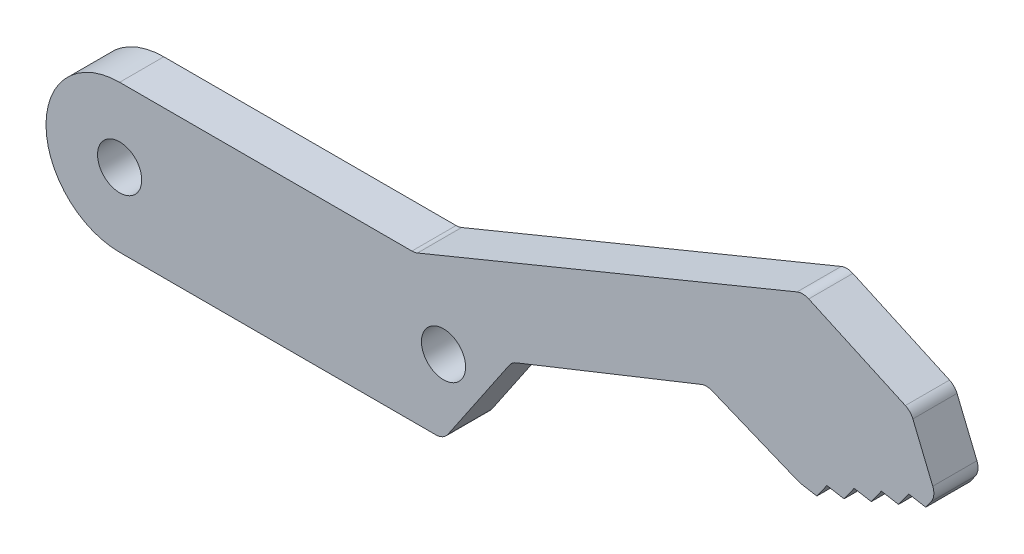
ISO-10303-21;
HEADER;
FILE_DESCRIPTION(('STEP AP214'),'2;1');
FILE_NAME('part.step','',(''),(''),'','','');
FILE_SCHEMA(('AUTOMOTIVE_DESIGN { 1 0 10303 214 1 1 1 1 }'));
ENDSEC;
DATA;
#1=APPLICATION_CONTEXT('core data for automotive mechanical design processes');
#2=APPLICATION_PROTOCOL_DEFINITION('international standard','automotive_design',2000,#1);
#3=PRODUCT_CONTEXT('',#1,'mechanical');
#4=PRODUCT('Part','Part','',(#3));
#5=PRODUCT_RELATED_PRODUCT_CATEGORY('part','',(#4));
#6=PRODUCT_DEFINITION_FORMATION('','',#4);
#7=PRODUCT_DEFINITION_CONTEXT('part definition',#1,'design');
#8=PRODUCT_DEFINITION('design','',#6,#7);
#9=PRODUCT_DEFINITION_SHAPE('','',#8);
#10=(LENGTH_UNIT() NAMED_UNIT(*) SI_UNIT(.MILLI.,.METRE.));
#11=(NAMED_UNIT(*) PLANE_ANGLE_UNIT() SI_UNIT($,.RADIAN.));
#12=(NAMED_UNIT(*) SI_UNIT($,.STERADIAN.) SOLID_ANGLE_UNIT());
#13=UNCERTAINTY_MEASURE_WITH_UNIT(LENGTH_MEASURE(1.E-05),#10,'distance_accuracy_value','');
#14=(GEOMETRIC_REPRESENTATION_CONTEXT(3) GLOBAL_UNCERTAINTY_ASSIGNED_CONTEXT((#13)) GLOBAL_UNIT_ASSIGNED_CONTEXT((#10,
#11,#12)) REPRESENTATION_CONTEXT('',''));
#15=CARTESIAN_POINT('',(0.,0.,0.));
#16=DIRECTION('',(0.,0.,1.));
#17=DIRECTION('',(1.,0.,0.));
#18=AXIS2_PLACEMENT_3D('',#15,#16,#17);
#19=CARTESIAN_POINT('',(17.3962094769043,-11.7918515015879,3.));
#20=DIRECTION('',(0.82775687017251,-0.561086948593719,0.));
#21=DIRECTION('',(0.561086948593719,0.82775687017251,0.));
#22=AXIS2_PLACEMENT_3D('',#19,#20,#21);
#23=PLANE('',#22);
#24=DIRECTION('',(-0.561086948593719,-0.82775687017251,0.));
#25=VECTOR('',#24,1.);
#26=CARTESIAN_POINT('',(17.3962094769043,-11.7918515015879,0.));
#27=LINE('',#26,#25);
#28=CARTESIAN_POINT('',(26.4721926347983,1.59770858592846,0.));
#29=VERTEX_POINT('',#28);
#30=CARTESIAN_POINT('',(22.2975129456313,-4.56108694859372,0.));
#31=VERTEX_POINT('',#30);
#32=EDGE_CURVE('E353',#29,#31,#27,.T.);
#33=ORIENTED_EDGE('',*,*,#32,.F.);
#34=DIRECTION('',(0.,0.,-1.));
#35=VECTOR('',#34,1.);
#36=CARTESIAN_POINT('',(26.4721926347983,1.59770858592845,3.));
#37=LINE('',#36,#35);
#38=CARTESIAN_POINT('',(26.4721926347983,1.59770858592846,3.));
#39=VERTEX_POINT('',#38);
#40=EDGE_CURVE('E256',#29,#39,#37,.F.);
#41=ORIENTED_EDGE('',*,*,#40,.T.);
#42=DIRECTION('',(-0.561086948593719,-0.82775687017251,0.));
#43=VECTOR('',#42,1.);
#44=CARTESIAN_POINT('',(17.3962094769043,-11.7918515015879,3.));
#45=LINE('',#44,#43);
#46=CARTESIAN_POINT('',(22.2975129456313,-4.56108694859372,3.));
#47=VERTEX_POINT('',#46);
#48=EDGE_CURVE('E770',#39,#47,#45,.T.);
#49=ORIENTED_EDGE('',*,*,#48,.T.);
#50=DIRECTION('',(0.,0.,-1.));
#51=VECTOR('',#50,1.);
#52=CARTESIAN_POINT('',(22.2975129456313,-4.56108694859372,0.));
#53=LINE('',#52,#51);
#54=EDGE_CURVE('E253',#47,#31,#53,.T.);
#55=ORIENTED_EDGE('',*,*,#54,.T.);
#56=EDGE_LOOP('',(#33,#41,#49,#55));
#57=FACE_BOUND('',#56,.T.);
#58=ADVANCED_FACE('F36',(#57),#23,.T.);
#59=CARTESIAN_POINT('',(3.01771045687276,-7.56855690668185,3.));
#60=DIRECTION('',(0.370362872235569,-0.928887152925166,0.));
#61=DIRECTION('',(0.928887152925166,0.370362872235569,0.));
#62=AXIS2_PLACEMENT_3D('',#59,#60,#61);
#63=PLANE('',#62);
#64=DIRECTION('',(-0.928887152925166,-0.370362872235569,0.));
#65=VECTOR('',#64,1.);
#66=CARTESIAN_POINT('',(3.01771045687276,-7.56855690668185,3.));
#67=LINE('',#66,#65);
#68=CARTESIAN_POINT('',(39.4964940516571,6.97614534835353,3.));
#69=VERTEX_POINT('',#68);
#70=CARTESIAN_POINT('',(26.9295866327353,1.9655087902599,3.));
#71=VERTEX_POINT('',#70);
#72=EDGE_CURVE('E777',#69,#71,#67,.T.);
#73=ORIENTED_EDGE('',*,*,#72,.T.);
#74=DIRECTION('',(0.,0.,-1.));
#75=VECTOR('',#74,1.);
#76=CARTESIAN_POINT('',(26.9295866327353,1.9655087902599,0.));
#77=LINE('',#76,#75);
#78=CARTESIAN_POINT('',(26.9295866327353,1.9655087902599,0.));
#79=VERTEX_POINT('',#78);
#80=EDGE_CURVE('E245',#71,#79,#77,.T.);
#81=ORIENTED_EDGE('',*,*,#80,.T.);
#82=DIRECTION('',(-0.928887152925166,-0.370362872235569,0.));
#83=VECTOR('',#82,1.);
#84=CARTESIAN_POINT('',(3.01771045687276,-7.56855690668185,0.));
#85=LINE('',#84,#83);
#86=CARTESIAN_POINT('',(39.4964940516571,6.97614534835353,0.));
#87=VERTEX_POINT('',#86);
#88=EDGE_CURVE('E355',#87,#79,#85,.T.);
#89=ORIENTED_EDGE('',*,*,#88,.F.);
#90=DIRECTION('',(0.,0.,-1.));
#91=VECTOR('',#90,1.);
#92=CARTESIAN_POINT('',(39.4964940516571,6.97614534835353,3.));
#93=LINE('',#92,#91);
#94=EDGE_CURVE('E243',#87,#69,#93,.F.);
#95=ORIENTED_EDGE('',*,*,#94,.T.);
#96=EDGE_LOOP('',(#73,#81,#89,#95));
#97=FACE_BOUND('',#96,.T.);
#98=ADVANCED_FACE('F498',(#97),#63,.T.);
#99=CARTESIAN_POINT('',(8.22079154562797,20.0822867610106,3.));
#100=DIRECTION('',(-0.378842481424512,-0.925461168428,0.));
#101=DIRECTION('',(0.925461168428,-0.378842481424512,0.));
#102=AXIS2_PLACEMENT_3D('',#99,#100,#101);
#103=PLANE('',#102);
#104=DIRECTION('',(-0.925461168428,0.378842481424512,0.));
#105=VECTOR('',#104,1.);
#106=CARTESIAN_POINT('',(8.22079154562797,20.0822867610106,3.));
#107=LINE('',#106,#105);
#108=CARTESIAN_POINT('',(46.0879419933528,4.58116609869354,3.));
#109=VERTEX_POINT('',#108);
#110=CARTESIAN_POINT('',(40.2456994053172,6.97271936385637,3.));
#111=VERTEX_POINT('',#110);
#112=EDGE_CURVE('E228',#109,#111,#107,.T.);
#113=ORIENTED_EDGE('',*,*,#112,.T.);
#114=DIRECTION('',(0.,0.,-1.));
#115=VECTOR('',#114,1.);
#116=CARTESIAN_POINT('',(40.2456994053171,6.97271936385637,0.));
#117=LINE('',#116,#115);
#118=CARTESIAN_POINT('',(40.2456994053172,6.97271936385637,0.));
#119=VERTEX_POINT('',#118);
#120=EDGE_CURVE('E280',#111,#119,#117,.T.);
#121=ORIENTED_EDGE('',*,*,#120,.T.);
#122=DIRECTION('',(-0.925461168428,0.378842481424512,0.));
#123=VECTOR('',#122,1.);
#124=CARTESIAN_POINT('',(8.22079154562797,20.0822867610106,0.));
#125=LINE('',#124,#123);
#126=CARTESIAN_POINT('',(46.0879419933528,4.58116609869354,0.));
#127=VERTEX_POINT('',#126);
#128=EDGE_CURVE('E358',#127,#119,#125,.T.);
#129=ORIENTED_EDGE('',*,*,#128,.F.);
#130=DIRECTION('',(0.,0.,-1.));
#131=VECTOR('',#130,1.);
#132=CARTESIAN_POINT('',(46.0879419933528,4.58116609869354,3.));
#133=LINE('',#132,#131);
#134=EDGE_CURVE('E278',#127,#109,#133,.F.);
#135=ORIENTED_EDGE('',*,*,#134,.T.);
#136=EDGE_LOOP('',(#113,#121,#129,#135));
#137=FACE_BOUND('',#136,.T.);
#138=ADVANCED_FACE('F504',(#137),#103,.T.);
#139=CARTESIAN_POINT('',(2.12068725055261,12.2001062019428,3.));
#140=DIRECTION('',(0.171257275030367,0.985226342395073,0.));
#141=DIRECTION('',(-0.985226342395073,0.171257275030367,0.));
#142=AXIS2_PLACEMENT_3D('',#139,#140,#141);
#143=PLANE('',#142);
#144=DIRECTION('',(0.985226342395073,-0.171257275030367,0.));
#145=VECTOR('',#144,1.);
#146=CARTESIAN_POINT('',(2.12068725055261,12.2001062019428,3.));
#147=LINE('',#146,#145);
#148=CARTESIAN_POINT('',(46.2955271997469,4.52140092472648,3.));
#149=VERTEX_POINT('',#148);
#150=CARTESIAN_POINT('',(47.3529322035688,4.33759717145107,3.));
#151=VERTEX_POINT('',#150);
#152=EDGE_CURVE('E214',#149,#151,#147,.T.);
#153=ORIENTED_EDGE('',*,*,#152,.F.);
#154=DIRECTION('',(0.,0.,-1.));
#155=VECTOR('',#154,1.);
#156=CARTESIAN_POINT('',(46.2955271997469,4.52140092472648,0.));
#157=LINE('',#156,#155);
#158=CARTESIAN_POINT('',(46.2955271997469,4.52140092472648,0.));
#159=VERTEX_POINT('',#158);
#160=EDGE_CURVE('E283',#149,#159,#157,.T.);
#161=ORIENTED_EDGE('',*,*,#160,.T.);
#162=DIRECTION('',(0.985226342395073,-0.171257275030367,0.));
#163=VECTOR('',#162,1.);
#164=CARTESIAN_POINT('',(2.12068725055261,12.2001062019428,0.));
#165=LINE('',#164,#163);
#166=CARTESIAN_POINT('',(47.3529322035688,4.33759717145107,0.));
#167=VERTEX_POINT('',#166);
#168=EDGE_CURVE('E241',#159,#167,#165,.T.);
#169=ORIENTED_EDGE('',*,*,#168,.T.);
#170=DIRECTION('',(0.,0.,-1.));
#171=VECTOR('',#170,1.);
#172=CARTESIAN_POINT('',(47.3529322035688,4.33759717145107,3.));
#173=LINE('',#172,#171);
#174=EDGE_CURVE('E234',#151,#167,#173,.T.);
#175=ORIENTED_EDGE('',*,*,#174,.F.);
#176=EDGE_LOOP('',(#153,#161,#169,#175));
#177=FACE_BOUND('',#176,.T.);
#178=ADVANCED_FACE('F239',(#177),#143,.F.);
#179=CARTESIAN_POINT('',(29.3832302084347,-20.911746854221,3.));
#180=DIRECTION('',(-0.814732571298571,0.579836905746106,0.));
#181=DIRECTION('',(-0.579836905746107,-0.814732571298571,0.));
#182=AXIS2_PLACEMENT_3D('',#179,#180,#181);
#183=PLANE('',#182);
#184=DIRECTION('',(0.579836905746107,0.814732571298571,0.));
#185=VECTOR('',#184,1.);
#186=CARTESIAN_POINT('',(29.3832302084347,-20.911746854221,0.));
#187=LINE('',#186,#185);
#188=CARTESIAN_POINT('',(48.0382444817135,5.30053386792921,0.));
#189=VERTEX_POINT('',#188);
#190=EDGE_CURVE('E362',#167,#189,#187,.T.);
#191=ORIENTED_EDGE('',*,*,#190,.T.);
#192=DIRECTION('',(0.,0.,-1.));
#193=VECTOR('',#192,1.);
#194=CARTESIAN_POINT('',(48.0382444817135,5.30053386792921,3.));
#195=LINE('',#194,#193);
#196=CARTESIAN_POINT('',(48.0382444817135,5.30053386792921,3.));
#197=VERTEX_POINT('',#196);
#198=EDGE_CURVE('E236',#197,#189,#195,.T.);
#199=ORIENTED_EDGE('',*,*,#198,.F.);
#200=DIRECTION('',(0.579836905746107,0.814732571298571,0.));
#201=VECTOR('',#200,1.);
#202=CARTESIAN_POINT('',(29.3832302084347,-20.911746854221,3.));
#203=LINE('',#202,#201);
#204=EDGE_CURVE('E219',#151,#197,#203,.T.);
#205=ORIENTED_EDGE('',*,*,#204,.F.);
#206=ORIENTED_EDGE('',*,*,#174,.T.);
#207=EDGE_LOOP('',(#191,#199,#205,#206));
#208=FACE_BOUND('',#207,.T.);
#209=ADVANCED_FACE('F233',(#208),#183,.F.);
#210=CARTESIAN_POINT('',(2.30326040358772,13.2504316830205,3.));
#211=DIRECTION('',(0.171257275030366,0.985226342395073,0.));
#212=DIRECTION('',(-0.985226342395073,0.171257275030366,0.));
#213=AXIS2_PLACEMENT_3D('',#210,#211,#212);
#214=PLANE('',#213);
#215=DIRECTION('',(0.985226342395073,-0.171257275030366,0.));
#216=VECTOR('',#215,1.);
#217=CARTESIAN_POINT('',(2.30326040358772,13.2504316830205,0.));
#218=LINE('',#217,#216);
#219=CARTESIAN_POINT('',(49.2026886599019,5.09812399691749,0.));
#220=VERTEX_POINT('',#219);
#221=EDGE_CURVE('E364',#189,#220,#218,.T.);
#222=ORIENTED_EDGE('',*,*,#221,.T.);
#223=DIRECTION('',(0.,0.,-1.));
#224=VECTOR('',#223,1.);
#225=CARTESIAN_POINT('',(49.2026886599019,5.09812399691749,3.));
#226=LINE('',#225,#224);
#227=CARTESIAN_POINT('',(49.2026886599019,5.09812399691749,3.));
#228=VERTEX_POINT('',#227);
#229=EDGE_CURVE('E247',#228,#220,#226,.T.);
#230=ORIENTED_EDGE('',*,*,#229,.F.);
#231=DIRECTION('',(0.985226342395073,-0.171257275030366,0.));
#232=VECTOR('',#231,1.);
#233=CARTESIAN_POINT('',(2.30326040358772,13.2504316830205,3.));
#234=LINE('',#233,#232);
#235=EDGE_CURVE('E237',#197,#228,#234,.T.);
#236=ORIENTED_EDGE('',*,*,#235,.F.);
#237=ORIENTED_EDGE('',*,*,#198,.T.);
#238=EDGE_LOOP('',(#222,#230,#236,#237));
#239=FACE_BOUND('',#238,.T.);
#240=ADVANCED_FACE('F429',(#239),#214,.F.);
#241=CARTESIAN_POINT('',(30.2517964891723,-21.5298966648462,3.));
#242=DIRECTION('',(-0.81473257129857,0.579836905746108,0.));
#243=DIRECTION('',(-0.579836905746108,-0.81473257129857,0.));
#244=AXIS2_PLACEMENT_3D('',#241,#242,#243);
#245=PLANE('',#244);
#246=DIRECTION('',(0.579836905746108,0.81473257129857,0.));
#247=VECTOR('',#246,1.);
#248=CARTESIAN_POINT('',(30.2517964891723,-21.5298966648462,0.));
#249=LINE('',#248,#247);
#250=CARTESIAN_POINT('',(49.8880009380466,6.06106069339563,0.));
#251=VERTEX_POINT('',#250);
#252=EDGE_CURVE('E367',#220,#251,#249,.T.);
#253=ORIENTED_EDGE('',*,*,#252,.T.);
#254=DIRECTION('',(0.,0.,-1.));
#255=VECTOR('',#254,1.);
#256=CARTESIAN_POINT('',(49.8880009380466,6.06106069339563,3.));
#257=LINE('',#256,#255);
#258=CARTESIAN_POINT('',(49.8880009380466,6.06106069339563,3.));
#259=VERTEX_POINT('',#258);
#260=EDGE_CURVE('E419',#259,#251,#257,.T.);
#261=ORIENTED_EDGE('',*,*,#260,.F.);
#262=DIRECTION('',(0.579836905746108,0.81473257129857,0.));
#263=VECTOR('',#262,1.);
#264=CARTESIAN_POINT('',(30.2517964891723,-21.5298966648462,3.));
#265=LINE('',#264,#263);
#266=EDGE_CURVE('E427',#228,#259,#265,.T.);
#267=ORIENTED_EDGE('',*,*,#266,.F.);
#268=ORIENTED_EDGE('',*,*,#229,.T.);
#269=EDGE_LOOP('',(#253,#261,#267,#268));
#270=FACE_BOUND('',#269,.T.);
#271=ADVANCED_FACE('F424',(#270),#245,.F.);
#272=CARTESIAN_POINT('',(2.48583355662284,14.3007571640983,3.));
#273=DIRECTION('',(0.171257275030366,0.985226342395073,0.));
#274=DIRECTION('',(-0.985226342395073,0.171257275030366,0.));
#275=AXIS2_PLACEMENT_3D('',#272,#273,#274);
#276=PLANE('',#275);
#277=DIRECTION('',(0.985226342395073,-0.171257275030366,0.));
#278=VECTOR('',#277,1.);
#279=CARTESIAN_POINT('',(2.48583355662284,14.3007571640983,0.));
#280=LINE('',#279,#278);
#281=CARTESIAN_POINT('',(51.052445116235,5.85865082238391,0.));
#282=VERTEX_POINT('',#281);
#283=EDGE_CURVE('E370',#251,#282,#280,.T.);
#284=ORIENTED_EDGE('',*,*,#283,.T.);
#285=DIRECTION('',(0.,0.,-1.));
#286=VECTOR('',#285,1.);
#287=CARTESIAN_POINT('',(51.052445116235,5.85865082238391,3.));
#288=LINE('',#287,#286);
#289=CARTESIAN_POINT('',(51.052445116235,5.85865082238391,3.));
#290=VERTEX_POINT('',#289);
#291=EDGE_CURVE('E416',#290,#282,#288,.T.);
#292=ORIENTED_EDGE('',*,*,#291,.F.);
#293=DIRECTION('',(0.985226342395073,-0.171257275030366,0.));
#294=VECTOR('',#293,1.);
#295=CARTESIAN_POINT('',(2.48583355662284,14.3007571640983,3.));
#296=LINE('',#295,#294);
#297=EDGE_CURVE('E434',#259,#290,#296,.T.);
#298=ORIENTED_EDGE('',*,*,#297,.F.);
#299=ORIENTED_EDGE('',*,*,#260,.T.);
#300=EDGE_LOOP('',(#284,#292,#298,#299));
#301=FACE_BOUND('',#300,.T.);
#302=ADVANCED_FACE('F432',(#301),#276,.F.);
#303=CARTESIAN_POINT('',(31.1203627699101,-22.1480464754713,3.));
#304=DIRECTION('',(-0.814732571298571,0.579836905746105,0.));
#305=DIRECTION('',(-0.579836905746105,-0.814732571298572,0.));
#306=AXIS2_PLACEMENT_3D('',#303,#304,#305);
#307=PLANE('',#306);
#308=DIRECTION('',(0.579836905746105,0.814732571298572,0.));
#309=VECTOR('',#308,1.);
#310=CARTESIAN_POINT('',(31.1203627699101,-22.1480464754713,0.));
#311=LINE('',#310,#309);
#312=CARTESIAN_POINT('',(51.7377573943797,6.82158751886204,0.));
#313=VERTEX_POINT('',#312);
#314=EDGE_CURVE('E373',#282,#313,#311,.T.);
#315=ORIENTED_EDGE('',*,*,#314,.T.);
#316=DIRECTION('',(0.,0.,-1.));
#317=VECTOR('',#316,1.);
#318=CARTESIAN_POINT('',(51.7377573943797,6.82158751886204,3.));
#319=LINE('',#318,#317);
#320=CARTESIAN_POINT('',(51.7377573943797,6.82158751886204,3.));
#321=VERTEX_POINT('',#320);
#322=EDGE_CURVE('E413',#321,#313,#319,.T.);
#323=ORIENTED_EDGE('',*,*,#322,.F.);
#324=DIRECTION('',(0.579836905746105,0.814732571298572,0.));
#325=VECTOR('',#324,1.);
#326=CARTESIAN_POINT('',(31.1203627699101,-22.1480464754713,3.));
#327=LINE('',#326,#325);
#328=EDGE_CURVE('E436',#290,#321,#327,.T.);
#329=ORIENTED_EDGE('',*,*,#328,.F.);
#330=ORIENTED_EDGE('',*,*,#291,.T.);
#331=EDGE_LOOP('',(#315,#323,#329,#330));
#332=FACE_BOUND('',#331,.T.);
#333=ADVANCED_FACE('F488',(#332),#307,.F.);
#334=CARTESIAN_POINT('',(2.66840670965796,15.351082645176,3.));
#335=DIRECTION('',(0.171257275030366,0.985226342395073,0.));
#336=DIRECTION('',(-0.985226342395073,0.171257275030366,0.));
#337=AXIS2_PLACEMENT_3D('',#334,#335,#336);
#338=PLANE('',#337);
#339=DIRECTION('',(0.985226342395073,-0.171257275030366,0.));
#340=VECTOR('',#339,1.);
#341=CARTESIAN_POINT('',(2.66840670965796,15.351082645176,0.));
#342=LINE('',#341,#340);
#343=CARTESIAN_POINT('',(52.9022015725681,6.61917764785032,0.));
#344=VERTEX_POINT('',#343);
#345=EDGE_CURVE('E376',#313,#344,#342,.T.);
#346=ORIENTED_EDGE('',*,*,#345,.T.);
#347=DIRECTION('',(0.,0.,-1.));
#348=VECTOR('',#347,1.);
#349=CARTESIAN_POINT('',(52.9022015725681,6.61917764785032,3.));
#350=LINE('',#349,#348);
#351=CARTESIAN_POINT('',(52.9022015725681,6.61917764785032,3.));
#352=VERTEX_POINT('',#351);
#353=EDGE_CURVE('E410',#352,#344,#350,.T.);
#354=ORIENTED_EDGE('',*,*,#353,.F.);
#355=DIRECTION('',(0.985226342395073,-0.171257275030366,0.));
#356=VECTOR('',#355,1.);
#357=CARTESIAN_POINT('',(2.66840670965796,15.351082645176,3.));
#358=LINE('',#357,#356);
#359=EDGE_CURVE('E442',#321,#352,#358,.T.);
#360=ORIENTED_EDGE('',*,*,#359,.F.);
#361=ORIENTED_EDGE('',*,*,#322,.T.);
#362=EDGE_LOOP('',(#346,#354,#360,#361));
#363=FACE_BOUND('',#362,.T.);
#364=ADVANCED_FACE('F485',(#363),#338,.F.);
#365=CARTESIAN_POINT('',(31.988929050648,-22.7661962860964,3.));
#366=DIRECTION('',(-0.814732571298574,0.579836905746103,0.));
#367=DIRECTION('',(-0.579836905746103,-0.814732571298574,0.));
#368=AXIS2_PLACEMENT_3D('',#365,#366,#367);
#369=PLANE('',#368);
#370=DIRECTION('',(0.579836905746103,0.814732571298574,0.));
#371=VECTOR('',#370,1.);
#372=CARTESIAN_POINT('',(31.988929050648,-22.7661962860964,0.));
#373=LINE('',#372,#371);
#374=CARTESIAN_POINT('',(53.5875138507128,7.58211434432846,0.));
#375=VERTEX_POINT('',#374);
#376=EDGE_CURVE('E379',#344,#375,#373,.T.);
#377=ORIENTED_EDGE('',*,*,#376,.T.);
#378=DIRECTION('',(0.,0.,-1.));
#379=VECTOR('',#378,1.);
#380=CARTESIAN_POINT('',(53.5875138507128,7.58211434432846,3.));
#381=LINE('',#380,#379);
#382=CARTESIAN_POINT('',(53.5875138507128,7.58211434432846,3.));
#383=VERTEX_POINT('',#382);
#384=EDGE_CURVE('E407',#383,#375,#381,.T.);
#385=ORIENTED_EDGE('',*,*,#384,.F.);
#386=DIRECTION('',(0.579836905746103,0.814732571298574,0.));
#387=VECTOR('',#386,1.);
#388=CARTESIAN_POINT('',(31.988929050648,-22.7661962860964,3.));
#389=LINE('',#388,#387);
#390=EDGE_CURVE('E445',#352,#383,#389,.T.);
#391=ORIENTED_EDGE('',*,*,#390,.F.);
#392=ORIENTED_EDGE('',*,*,#353,.T.);
#393=EDGE_LOOP('',(#377,#385,#391,#392));
#394=FACE_BOUND('',#393,.T.);
#395=ADVANCED_FACE('F483',(#394),#369,.F.);
#396=CARTESIAN_POINT('',(2.85097986269345,16.4014081262544,3.));
#397=DIRECTION('',(0.171257275030381,0.98522634239507,0.));
#398=DIRECTION('',(-0.985226342395071,0.171257275030381,0.));
#399=AXIS2_PLACEMENT_3D('',#396,#397,#398);
#400=PLANE('',#399);
#401=DIRECTION('',(0.98522634239507,-0.171257275030381,0.));
#402=VECTOR('',#401,1.);
#403=CARTESIAN_POINT('',(2.85097986269345,16.4014081262544,0.));
#404=LINE('',#403,#402);
#405=CARTESIAN_POINT('',(54.7519580289012,7.37970447331672,0.));
#406=VERTEX_POINT('',#405);
#407=EDGE_CURVE('E382',#375,#406,#404,.T.);
#408=ORIENTED_EDGE('',*,*,#407,.T.);
#409=DIRECTION('',(0.,0.,-1.));
#410=VECTOR('',#409,1.);
#411=CARTESIAN_POINT('',(54.7519580289012,7.37970447331672,3.));
#412=LINE('',#411,#410);
#413=CARTESIAN_POINT('',(54.7519580289012,7.37970447331672,3.));
#414=VERTEX_POINT('',#413);
#415=EDGE_CURVE('E404',#414,#406,#412,.T.);
#416=ORIENTED_EDGE('',*,*,#415,.F.);
#417=DIRECTION('',(0.98522634239507,-0.171257275030381,0.));
#418=VECTOR('',#417,1.);
#419=CARTESIAN_POINT('',(2.85097986269345,16.4014081262544,3.));
#420=LINE('',#419,#418);
#421=EDGE_CURVE('E448',#383,#414,#420,.T.);
#422=ORIENTED_EDGE('',*,*,#421,.F.);
#423=ORIENTED_EDGE('',*,*,#384,.T.);
#424=EDGE_LOOP('',(#408,#416,#422,#423));
#425=FACE_BOUND('',#424,.T.);
#426=ADVANCED_FACE('F479',(#425),#400,.F.);
#427=CARTESIAN_POINT('',(32.8574953313856,-23.3843460967215,3.));
#428=DIRECTION('',(-0.814732571298573,0.579836905746103,0.));
#429=DIRECTION('',(-0.579836905746103,-0.814732571298573,0.));
#430=AXIS2_PLACEMENT_3D('',#427,#428,#429);
#431=PLANE('',#430);
#432=DIRECTION('',(0.579836905746103,0.814732571298573,0.));
#433=VECTOR('',#432,1.);
#434=CARTESIAN_POINT('',(32.8574953313856,-23.3843460967215,0.));
#435=LINE('',#434,#433);
#436=CARTESIAN_POINT('',(55.1172552795213,7.89298599323486,0.));
#437=VERTEX_POINT('',#436);
#438=EDGE_CURVE('E385',#406,#437,#435,.T.);
#439=ORIENTED_EDGE('',*,*,#438,.T.);
#440=DIRECTION('',(0.,0.,-1.));
#441=VECTOR('',#440,1.);
#442=CARTESIAN_POINT('',(55.1172552795213,7.89298599323485,3.));
#443=LINE('',#442,#441);
#444=CARTESIAN_POINT('',(55.1172552795213,7.89298599323486,3.));
#445=VERTEX_POINT('',#444);
#446=EDGE_CURVE('E290',#437,#445,#443,.F.);
#447=ORIENTED_EDGE('',*,*,#446,.T.);
#448=DIRECTION('',(0.579836905746103,0.814732571298573,0.));
#449=VECTOR('',#448,1.);
#450=CARTESIAN_POINT('',(32.8574953313856,-23.3843460967215,3.));
#451=LINE('',#450,#449);
#452=EDGE_CURVE('E451',#414,#445,#451,.T.);
#453=ORIENTED_EDGE('',*,*,#452,.F.);
#454=ORIENTED_EDGE('',*,*,#415,.T.);
#455=EDGE_LOOP('',(#439,#447,#453,#454));
#456=FACE_BOUND('',#455,.T.);
#457=ADVANCED_FACE('F476',(#456),#431,.F.);
#458=CARTESIAN_POINT('',(50.3551112402656,20.703489243922,3.));
#459=DIRECTION('',(0.924878228166548,0.380263412733208,0.));
#460=DIRECTION('',(-0.380263412733208,0.924878228166548,0.));
#461=AXIS2_PLACEMENT_3D('',#458,#459,#460);
#462=PLANE('',#461);
#463=DIRECTION('',(0.380263412733209,-0.924878228166548,0.));
#464=VECTOR('',#463,1.);
#465=CARTESIAN_POINT('',(50.3551112402656,20.703489243922,3.));
#466=LINE('',#465,#464);
#467=CARTESIAN_POINT('',(53.8764912996726,12.138774256918,3.));
#468=VERTEX_POINT('',#467);
#469=CARTESIAN_POINT('',(55.2274009363892,8.85308631171416,3.));
#470=VERTEX_POINT('',#469);
#471=EDGE_CURVE('E454',#468,#470,#466,.T.);
#472=ORIENTED_EDGE('',*,*,#471,.T.);
#473=DIRECTION('',(0.,0.,-1.));
#474=VECTOR('',#473,1.);
#475=CARTESIAN_POINT('',(55.2274009363892,8.85308631171416,0.));
#476=LINE('',#475,#474);
#477=CARTESIAN_POINT('',(55.2274009363892,8.85308631171416,0.));
#478=VERTEX_POINT('',#477);
#479=EDGE_CURVE('E287',#470,#478,#476,.T.);
#480=ORIENTED_EDGE('',*,*,#479,.T.);
#481=DIRECTION('',(0.380263412733209,-0.924878228166548,0.));
#482=VECTOR('',#481,1.);
#483=CARTESIAN_POINT('',(50.3551112402656,20.703489243922,0.));
#484=LINE('',#483,#482);
#485=CARTESIAN_POINT('',(53.8764912996726,12.138774256918,0.));
#486=VERTEX_POINT('',#485);
#487=EDGE_CURVE('E388',#486,#478,#484,.T.);
#488=ORIENTED_EDGE('',*,*,#487,.F.);
#489=DIRECTION('',(0.,0.,-1.));
#490=VECTOR('',#489,1.);
#491=CARTESIAN_POINT('',(53.8764912996726,12.138774256918,3.));
#492=LINE('',#491,#490);
#493=EDGE_CURVE('E285',#486,#468,#492,.F.);
#494=ORIENTED_EDGE('',*,*,#493,.T.);
#495=EDGE_LOOP('',(#472,#480,#488,#494));
#496=FACE_BOUND('',#495,.T.);
#497=ADVANCED_FACE('F468',(#496),#462,.T.);
#498=CARTESIAN_POINT('',(13.9488099268583,30.6231164748254,3.));
#499=DIRECTION('',(0.414522259932087,0.910039172794663,0.));
#500=DIRECTION('',(-0.910039172794663,0.414522259932087,0.));
#501=AXIS2_PLACEMENT_3D('',#498,#499,#500);
#502=PLANE('',#501);
#503=DIRECTION('',(0.910039172794663,-0.414522259932087,0.));
#504=VECTOR('',#503,1.);
#505=CARTESIAN_POINT('',(13.9488099268583,30.6231164748254,3.));
#506=LINE('',#505,#504);
#507=CARTESIAN_POINT('',(46.8032086062433,15.6579589338968,3.));
#508=VERTEX_POINT('',#507);
#509=CARTESIAN_POINT('',(53.3661353314382,12.6685500169795,3.));
#510=VERTEX_POINT('',#509);
#511=EDGE_CURVE('E341',#508,#510,#506,.T.);
#512=ORIENTED_EDGE('',*,*,#511,.T.);
#513=DIRECTION('',(0.,0.,-1.));
#514=VECTOR('',#513,1.);
#515=CARTESIAN_POINT('',(53.3661353314382,12.6685500169795,3.));
#516=LINE('',#515,#514);
#517=CARTESIAN_POINT('',(53.3661353314382,12.6685500169795,0.));
#518=VERTEX_POINT('',#517);
#519=EDGE_CURVE('E294',#510,#518,#516,.T.);
#520=ORIENTED_EDGE('',*,*,#519,.T.);
#521=DIRECTION('',(0.910039172794663,-0.414522259932087,0.));
#522=VECTOR('',#521,1.);
#523=CARTESIAN_POINT('',(13.9488099268583,30.6231164748254,0.));
#524=LINE('',#523,#522);
#525=CARTESIAN_POINT('',(46.8032086062433,15.6579589338968,0.));
#526=VERTEX_POINT('',#525);
#527=EDGE_CURVE('E328',#526,#518,#524,.T.);
#528=ORIENTED_EDGE('',*,*,#527,.F.);
#529=DIRECTION('',(0.,0.,-1.));
#530=VECTOR('',#529,1.);
#531=CARTESIAN_POINT('',(46.8032086062433,15.6579589338968,3.));
#532=LINE('',#531,#530);
#533=EDGE_CURVE('E292',#526,#508,#532,.F.);
#534=ORIENTED_EDGE('',*,*,#533,.T.);
#535=EDGE_LOOP('',(#512,#520,#528,#534));
#536=FACE_BOUND('',#535,.T.);
#537=ADVANCED_FACE('F459',(#536),#502,.T.);
#538=CARTESIAN_POINT('',(1.14074851739701,-2.77453321099285,3.));
#539=DIRECTION('',(-0.380263412733207,0.924878228166549,0.));
#540=DIRECTION('',(-0.924878228166549,-0.380263412733207,0.));
#541=AXIS2_PLACEMENT_3D('',#538,#539,#540);
#542=PLANE('',#541);
#543=DIRECTION('',(0.924878228166549,0.380263412733207,0.));
#544=VECTOR('',#543,1.);
#545=CARTESIAN_POINT('',(1.14074851739701,-2.77453321099285,3.));
#546=LINE('',#545,#544);
#547=CARTESIAN_POINT('',(20.2327114807882,5.07512177183346,3.));
#548=VERTEX_POINT('',#547);
#549=CARTESIAN_POINT('',(46.0084229335781,15.6727979892687,3.));
#550=VERTEX_POINT('',#549);
#551=EDGE_CURVE('E337',#548,#550,#546,.T.);
#552=ORIENTED_EDGE('',*,*,#551,.T.);
#553=DIRECTION('',(0.,0.,-1.));
#554=VECTOR('',#553,1.);
#555=CARTESIAN_POINT('',(46.0084229335781,15.6727979892687,3.));
#556=LINE('',#555,#554);
#557=CARTESIAN_POINT('',(46.0084229335781,15.6727979892687,0.));
#558=VERTEX_POINT('',#557);
#559=EDGE_CURVE('E299',#550,#558,#556,.T.);
#560=ORIENTED_EDGE('',*,*,#559,.T.);
#561=DIRECTION('',(0.924878228166549,0.380263412733207,0.));
#562=VECTOR('',#561,1.);
#563=CARTESIAN_POINT('',(1.14074851739701,-2.77453321099285,0.));
#564=LINE('',#563,#562);
#565=CARTESIAN_POINT('',(20.2327114807882,5.07512177183346,0.));
#566=VERTEX_POINT('',#565);
#567=EDGE_CURVE('E318',#566,#558,#564,.T.);
#568=ORIENTED_EDGE('',*,*,#567,.F.);
#569=DIRECTION('',(0.,0.,-1.));
#570=VECTOR('',#569,1.);
#571=CARTESIAN_POINT('',(20.2327114807882,5.07512177183345,3.));
#572=LINE('',#571,#570);
#573=EDGE_CURVE('E297',#566,#548,#572,.F.);
#574=ORIENTED_EDGE('',*,*,#573,.T.);
#575=EDGE_LOOP('',(#552,#560,#568,#574));
#576=FACE_BOUND('',#575,.T.);
#577=ADVANCED_FACE('F326',(#576),#542,.T.);
#578=CARTESIAN_POINT('',(0.,5.,3.));
#579=DIRECTION('',(0.,1.,0.));
#580=DIRECTION('',(0.,0.,1.));
#581=AXIS2_PLACEMENT_3D('',#578,#579,#580);
#582=PLANE('',#581);
#583=DIRECTION('',(1.,0.,0.));
#584=VECTOR('',#583,1.);
#585=CARTESIAN_POINT('',(0.,5.,3.));
#586=LINE('',#585,#584);
#587=CARTESIAN_POINT('',(0.,5.,3.));
#588=VERTEX_POINT('',#587);
#589=CARTESIAN_POINT('',(19.852448068055,5.,3.));
#590=VERTEX_POINT('',#589);
#591=EDGE_CURVE('E332',#588,#590,#586,.T.);
#592=ORIENTED_EDGE('',*,*,#591,.T.);
#593=DIRECTION('',(0.,0.,-1.));
#594=VECTOR('',#593,1.);
#595=CARTESIAN_POINT('',(19.852448068055,5.,0.));
#596=LINE('',#595,#594);
#597=CARTESIAN_POINT('',(19.852448068055,5.,0.));
#598=VERTEX_POINT('',#597);
#599=EDGE_CURVE('E302',#590,#598,#596,.T.);
#600=ORIENTED_EDGE('',*,*,#599,.T.);
#601=DIRECTION('',(1.,0.,0.));
#602=VECTOR('',#601,1.);
#603=CARTESIAN_POINT('',(0.,5.,0.));
#604=LINE('',#603,#602);
#605=CARTESIAN_POINT('',(0.,5.,0.));
#606=VERTEX_POINT('',#605);
#607=EDGE_CURVE('E321',#606,#598,#604,.T.);
#608=ORIENTED_EDGE('',*,*,#607,.F.);
#609=DIRECTION('',(0.,0.,-1.));
#610=VECTOR('',#609,1.);
#611=CARTESIAN_POINT('',(0.,5.,3.));
#612=LINE('',#611,#610);
#613=EDGE_CURVE('E333',#588,#606,#612,.T.);
#614=ORIENTED_EDGE('',*,*,#613,.F.);
#615=EDGE_LOOP('',(#592,#600,#608,#614));
#616=FACE_BOUND('',#615,.T.);
#617=ADVANCED_FACE('F331',(#616),#582,.T.);
#618=CARTESIAN_POINT('',(0.,0.,3.));
#619=DIRECTION('',(0.,0.,-1.));
#620=DIRECTION('',(-1.,0.,0.));
#621=AXIS2_PLACEMENT_3D('',#618,#619,#620);
#622=CYLINDRICAL_SURFACE('',#621,5.);
#623=CARTESIAN_POINT('',(0.,0.,0.));
#624=DIRECTION('',(0.,0.,1.));
#625=DIRECTION('',(1.,0.,0.));
#626=AXIS2_PLACEMENT_3D('',#623,#624,#625);
#627=CIRCLE('',#626,5.);
#628=CARTESIAN_POINT('',(0.,-5.,0.));
#629=VERTEX_POINT('',#628);
#630=EDGE_CURVE('E394',#606,#629,#627,.T.);
#631=ORIENTED_EDGE('',*,*,#630,.T.);
#632=DIRECTION('',(0.,0.,-1.));
#633=VECTOR('',#632,1.);
#634=CARTESIAN_POINT('',(0.,-5.,3.));
#635=LINE('',#634,#633);
#636=CARTESIAN_POINT('',(0.,-5.,3.));
#637=VERTEX_POINT('',#636);
#638=EDGE_CURVE('E346',#637,#629,#635,.T.);
#639=ORIENTED_EDGE('',*,*,#638,.F.);
#640=CARTESIAN_POINT('',(0.,0.,3.));
#641=DIRECTION('',(0.,0.,1.));
#642=DIRECTION('',(1.,0.,0.));
#643=AXIS2_PLACEMENT_3D('',#640,#641,#642);
#644=CIRCLE('',#643,5.);
#645=EDGE_CURVE('E336',#588,#637,#644,.T.);
#646=ORIENTED_EDGE('',*,*,#645,.F.);
#647=ORIENTED_EDGE('',*,*,#613,.T.);
#648=EDGE_LOOP('',(#631,#639,#646,#647));
#649=FACE_BOUND('',#648,.T.);
#650=ADVANCED_FACE('F514',(#649),#622,.T.);
#651=CARTESIAN_POINT('',(0.,0.,3.));
#652=DIRECTION('',(0.,0.,-1.));
#653=DIRECTION('',(-1.,0.,0.));
#654=AXIS2_PLACEMENT_3D('',#651,#652,#653);
#655=CYLINDRICAL_SURFACE('',#654,1.5);
#656=CARTESIAN_POINT('',(0.,0.,3.));
#657=DIRECTION('',(0.,0.,1.));
#658=DIRECTION('',(1.,0.,0.));
#659=AXIS2_PLACEMENT_3D('',#656,#657,#658);
#660=CIRCLE('',#659,1.5);
#661=CARTESIAN_POINT('',(1.5,0.,3.));
#662=VERTEX_POINT('',#661);
#663=EDGE_CURVE('E782',#662,#662,#660,.T.);
#664=ORIENTED_EDGE('',*,*,#663,.T.);
#665=EDGE_LOOP('',(#664));
#666=FACE_BOUND('',#665,.T.);
#667=CARTESIAN_POINT('',(0.,0.,0.));
#668=DIRECTION('',(0.,0.,1.));
#669=DIRECTION('',(1.,0.,0.));
#670=AXIS2_PLACEMENT_3D('',#667,#668,#669);
#671=CIRCLE('',#670,1.5);
#672=CARTESIAN_POINT('',(1.5,0.,0.));
#673=VERTEX_POINT('',#672);
#674=EDGE_CURVE('E350',#673,#673,#671,.T.);
#675=ORIENTED_EDGE('',*,*,#674,.F.);
#676=EDGE_LOOP('',(#675));
#677=FACE_BOUND('',#676,.T.);
#678=ADVANCED_FACE('F510',(#666,#677),#655,.F.);
#679=CARTESIAN_POINT('',(22.,0.,3.));
#680=DIRECTION('',(0.,0.,-1.));
#681=DIRECTION('',(-1.,0.,0.));
#682=AXIS2_PLACEMENT_3D('',#679,#680,#681);
#683=CYLINDRICAL_SURFACE('',#682,1.5);
#684=CARTESIAN_POINT('',(22.,0.,3.));
#685=DIRECTION('',(0.,0.,1.));
#686=DIRECTION('',(1.,0.,0.));
#687=AXIS2_PLACEMENT_3D('',#684,#685,#686);
#688=CIRCLE('',#687,1.5);
#689=CARTESIAN_POINT('',(23.5,0.,3.));
#690=VERTEX_POINT('',#689);
#691=EDGE_CURVE('E400',#690,#690,#688,.T.);
#692=ORIENTED_EDGE('',*,*,#691,.T.);
#693=EDGE_LOOP('',(#692));
#694=FACE_BOUND('',#693,.T.);
#695=CARTESIAN_POINT('',(22.,0.,0.));
#696=DIRECTION('',(0.,0.,1.));
#697=DIRECTION('',(1.,0.,0.));
#698=AXIS2_PLACEMENT_3D('',#695,#696,#697);
#699=CIRCLE('',#698,1.5);
#700=CARTESIAN_POINT('',(23.5,0.,0.));
#701=VERTEX_POINT('',#700);
#702=EDGE_CURVE('E347',#701,#701,#699,.T.);
#703=ORIENTED_EDGE('',*,*,#702,.F.);
#704=EDGE_LOOP('',(#703));
#705=FACE_BOUND('',#704,.T.);
#706=ADVANCED_FACE('F513',(#694,#705),#683,.F.);
#707=CARTESIAN_POINT('',(0.,-5.,3.));
#708=DIRECTION('',(0.,1.,0.));
#709=DIRECTION('',(0.,0.,1.));
#710=AXIS2_PLACEMENT_3D('',#707,#708,#709);
#711=PLANE('',#710);
#712=DIRECTION('',(1.,0.,0.));
#713=VECTOR('',#712,1.);
#714=CARTESIAN_POINT('',(0.,-5.,0.));
#715=LINE('',#714,#713);
#716=CARTESIAN_POINT('',(21.4697560754588,-5.,0.));
#717=VERTEX_POINT('',#716);
#718=EDGE_CURVE('E397',#629,#717,#715,.T.);
#719=ORIENTED_EDGE('',*,*,#718,.T.);
#720=DIRECTION('',(0.,0.,-1.));
#721=VECTOR('',#720,1.);
#722=CARTESIAN_POINT('',(21.4697560754588,-5.,3.));
#723=LINE('',#722,#721);
#724=CARTESIAN_POINT('',(21.4697560754588,-5.,3.));
#725=VERTEX_POINT('',#724);
#726=EDGE_CURVE('E268',#717,#725,#723,.F.);
#727=ORIENTED_EDGE('',*,*,#726,.T.);
#728=DIRECTION('',(1.,0.,0.));
#729=VECTOR('',#728,1.);
#730=CARTESIAN_POINT('',(0.,-5.,3.));
#731=LINE('',#730,#729);
#732=EDGE_CURVE('E339',#637,#725,#731,.T.);
#733=ORIENTED_EDGE('',*,*,#732,.F.);
#734=ORIENTED_EDGE('',*,*,#638,.T.);
#735=EDGE_LOOP('',(#719,#727,#733,#734));
#736=FACE_BOUND('',#735,.T.);
#737=ADVANCED_FACE('F518',(#736),#711,.F.);
#738=CARTESIAN_POINT('',(0.,0.,3.));
#739=DIRECTION('',(0.,0.,1.));
#740=DIRECTION('',(1.,0.,0.));
#741=AXIS2_PLACEMENT_3D('',#738,#739,#740);
#742=PLANE('',#741);
#743=ORIENTED_EDGE('',*,*,#691,.F.);
#744=EDGE_LOOP('',(#743));
#745=FACE_BOUND('',#744,.T.);
#746=ORIENTED_EDGE('',*,*,#663,.F.);
#747=EDGE_LOOP('',(#746));
#748=FACE_BOUND('',#747,.T.);
#749=ORIENTED_EDGE('',*,*,#732,.T.);
#750=CARTESIAN_POINT('',(21.4697560754588,-4.,3.));
#751=DIRECTION('',(0.,0.,1.));
#752=DIRECTION('',(1.,0.,0.));
#753=AXIS2_PLACEMENT_3D('',#750,#751,#752);
#754=CIRCLE('',#753,1.);
#755=EDGE_CURVE('E276',#725,#47,#754,.T.);
#756=ORIENTED_EDGE('',*,*,#755,.T.);
#757=ORIENTED_EDGE('',*,*,#48,.F.);
#758=CARTESIAN_POINT('',(27.2999495049708,1.03662163733474,3.));
#759=DIRECTION('',(0.,0.,1.));
#760=DIRECTION('',(1.,0.,0.));
#761=AXIS2_PLACEMENT_3D('',#758,#759,#760);
#762=CIRCLE('',#761,1.);
#763=EDGE_CURVE('E307',#39,#71,#762,.F.);
#764=ORIENTED_EDGE('',*,*,#763,.T.);
#765=ORIENTED_EDGE('',*,*,#72,.F.);
#766=CARTESIAN_POINT('',(39.8668569238926,6.04725819542837,3.));
#767=DIRECTION('',(0.,0.,1.));
#768=DIRECTION('',(1.,0.,0.));
#769=AXIS2_PLACEMENT_3D('',#766,#767,#768);
#770=CIRCLE('',#769,1.);
#771=EDGE_CURVE('E311',#69,#111,#770,.F.);
#772=ORIENTED_EDGE('',*,*,#771,.T.);
#773=ORIENTED_EDGE('',*,*,#112,.F.);
#774=CARTESIAN_POINT('',(46.4667844747773,5.50662726712155,3.));
#775=DIRECTION('',(0.,0.,1.));
#776=DIRECTION('',(1.,0.,0.));
#777=AXIS2_PLACEMENT_3D('',#774,#775,#776);
#778=CIRCLE('',#777,1.);
#779=EDGE_CURVE('E223',#109,#149,#778,.T.);
#780=ORIENTED_EDGE('',*,*,#779,.T.);
#781=ORIENTED_EDGE('',*,*,#152,.T.);
#782=ORIENTED_EDGE('',*,*,#204,.T.);
#783=ORIENTED_EDGE('',*,*,#235,.T.);
#784=ORIENTED_EDGE('',*,*,#266,.T.);
#785=ORIENTED_EDGE('',*,*,#297,.T.);
#786=ORIENTED_EDGE('',*,*,#328,.T.);
#787=ORIENTED_EDGE('',*,*,#359,.T.);
#788=ORIENTED_EDGE('',*,*,#390,.T.);
#789=ORIENTED_EDGE('',*,*,#421,.T.);
#790=ORIENTED_EDGE('',*,*,#452,.T.);
#791=CARTESIAN_POINT('',(54.3025227082227,8.47282289898095,3.));
#792=DIRECTION('',(0.,0.,1.));
#793=DIRECTION('',(1.,0.,0.));
#794=AXIS2_PLACEMENT_3D('',#791,#792,#793);
#795=CIRCLE('',#794,1.);
#796=EDGE_CURVE('E273',#445,#470,#795,.T.);
#797=ORIENTED_EDGE('',*,*,#796,.T.);
#798=ORIENTED_EDGE('',*,*,#471,.F.);
#799=CARTESIAN_POINT('',(52.9516130715061,11.7585108441848,3.));
#800=DIRECTION('',(0.,0.,1.));
#801=DIRECTION('',(1.,0.,0.));
#802=AXIS2_PLACEMENT_3D('',#799,#800,#801);
#803=CIRCLE('',#802,1.);
#804=EDGE_CURVE('E271',#468,#510,#803,.T.);
#805=ORIENTED_EDGE('',*,*,#804,.T.);
#806=ORIENTED_EDGE('',*,*,#511,.F.);
#807=CARTESIAN_POINT('',(46.3886863463113,14.7479197611021,3.));
#808=DIRECTION('',(0.,0.,1.));
#809=DIRECTION('',(1.,0.,0.));
#810=AXIS2_PLACEMENT_3D('',#807,#808,#809);
#811=CIRCLE('',#810,1.);
#812=EDGE_CURVE('E55',#508,#550,#811,.T.);
#813=ORIENTED_EDGE('',*,*,#812,.T.);
#814=ORIENTED_EDGE('',*,*,#551,.F.);
#815=CARTESIAN_POINT('',(19.852448068055,6.,3.));
#816=DIRECTION('',(0.,0.,1.));
#817=DIRECTION('',(1.,0.,0.));
#818=AXIS2_PLACEMENT_3D('',#815,#816,#817);
#819=CIRCLE('',#818,1.);
#820=EDGE_CURVE('E11',#548,#590,#819,.F.);
#821=ORIENTED_EDGE('',*,*,#820,.T.);
#822=ORIENTED_EDGE('',*,*,#591,.F.);
#823=ORIENTED_EDGE('',*,*,#645,.T.);
#824=EDGE_LOOP('',(#749,#756,#757,#764,#765,#772,#773,#780,#781,#782,#783,#784,#785,#786,#787,
#788,#789,#790,#797,#798,#805,#806,#813,#814,#821,#822,#823));
#825=FACE_BOUND('',#824,.T.);
#826=ADVANCED_FACE('F217',(#745,#748,#825),#742,.T.);
#827=CARTESIAN_POINT('',(0.,0.,0.));
#828=DIRECTION('',(0.,0.,1.));
#829=DIRECTION('',(1.,0.,0.));
#830=AXIS2_PLACEMENT_3D('',#827,#828,#829);
#831=PLANE('',#830);
#832=ORIENTED_EDGE('',*,*,#702,.T.);
#833=EDGE_LOOP('',(#832));
#834=FACE_BOUND('',#833,.T.);
#835=ORIENTED_EDGE('',*,*,#674,.T.);
#836=EDGE_LOOP('',(#835));
#837=FACE_BOUND('',#836,.T.);
#838=ORIENTED_EDGE('',*,*,#32,.T.);
#839=CARTESIAN_POINT('',(21.4697560754588,-4.,0.));
#840=DIRECTION('',(0.,0.,1.));
#841=DIRECTION('',(1.,0.,0.));
#842=AXIS2_PLACEMENT_3D('',#839,#840,#841);
#843=CIRCLE('',#842,1.);
#844=EDGE_CURVE('E266',#31,#717,#843,.F.);
#845=ORIENTED_EDGE('',*,*,#844,.T.);
#846=ORIENTED_EDGE('',*,*,#718,.F.);
#847=ORIENTED_EDGE('',*,*,#630,.F.);
#848=ORIENTED_EDGE('',*,*,#607,.T.);
#849=CARTESIAN_POINT('',(19.852448068055,6.,0.));
#850=DIRECTION('',(0.,0.,1.));
#851=DIRECTION('',(1.,0.,0.));
#852=AXIS2_PLACEMENT_3D('',#849,#850,#851);
#853=CIRCLE('',#852,1.);
#854=EDGE_CURVE('E44',#598,#566,#853,.T.);
#855=ORIENTED_EDGE('',*,*,#854,.T.);
#856=ORIENTED_EDGE('',*,*,#567,.T.);
#857=CARTESIAN_POINT('',(46.3886863463113,14.7479197611021,0.));
#858=DIRECTION('',(0.,0.,1.));
#859=DIRECTION('',(1.,0.,0.));
#860=AXIS2_PLACEMENT_3D('',#857,#858,#859);
#861=CIRCLE('',#860,1.);
#862=EDGE_CURVE('E258',#558,#526,#861,.F.);
#863=ORIENTED_EDGE('',*,*,#862,.T.);
#864=ORIENTED_EDGE('',*,*,#527,.T.);
#865=CARTESIAN_POINT('',(52.9516130715061,11.7585108441848,0.));
#866=DIRECTION('',(0.,0.,1.));
#867=DIRECTION('',(1.,0.,0.));
#868=AXIS2_PLACEMENT_3D('',#865,#866,#867);
#869=CIRCLE('',#868,1.);
#870=EDGE_CURVE('E260',#518,#486,#869,.F.);
#871=ORIENTED_EDGE('',*,*,#870,.T.);
#872=ORIENTED_EDGE('',*,*,#487,.T.);
#873=CARTESIAN_POINT('',(54.3025227082227,8.47282289898095,0.));
#874=DIRECTION('',(0.,0.,1.));
#875=DIRECTION('',(1.,0.,0.));
#876=AXIS2_PLACEMENT_3D('',#873,#874,#875);
#877=CIRCLE('',#876,1.);
#878=EDGE_CURVE('E262',#478,#437,#877,.F.);
#879=ORIENTED_EDGE('',*,*,#878,.T.);
#880=ORIENTED_EDGE('',*,*,#438,.F.);
#881=ORIENTED_EDGE('',*,*,#407,.F.);
#882=ORIENTED_EDGE('',*,*,#376,.F.);
#883=ORIENTED_EDGE('',*,*,#345,.F.);
#884=ORIENTED_EDGE('',*,*,#314,.F.);
#885=ORIENTED_EDGE('',*,*,#283,.F.);
#886=ORIENTED_EDGE('',*,*,#252,.F.);
#887=ORIENTED_EDGE('',*,*,#221,.F.);
#888=ORIENTED_EDGE('',*,*,#190,.F.);
#889=ORIENTED_EDGE('',*,*,#168,.F.);
#890=CARTESIAN_POINT('',(46.4667844747773,5.50662726712155,0.));
#891=DIRECTION('',(0.,0.,1.));
#892=DIRECTION('',(1.,0.,0.));
#893=AXIS2_PLACEMENT_3D('',#890,#891,#892);
#894=CIRCLE('',#893,1.);
#895=EDGE_CURVE('E264',#159,#127,#894,.F.);
#896=ORIENTED_EDGE('',*,*,#895,.T.);
#897=ORIENTED_EDGE('',*,*,#128,.T.);
#898=CARTESIAN_POINT('',(39.8668569238926,6.04725819542837,0.));
#899=DIRECTION('',(0.,0.,1.));
#900=DIRECTION('',(1.,0.,0.));
#901=AXIS2_PLACEMENT_3D('',#898,#899,#900);
#902=CIRCLE('',#901,1.);
#903=EDGE_CURVE('E309',#119,#87,#902,.T.);
#904=ORIENTED_EDGE('',*,*,#903,.T.);
#905=ORIENTED_EDGE('',*,*,#88,.T.);
#906=CARTESIAN_POINT('',(27.2999495049708,1.03662163733474,0.));
#907=DIRECTION('',(0.,0.,1.));
#908=DIRECTION('',(1.,0.,0.));
#909=AXIS2_PLACEMENT_3D('',#906,#907,#908);
#910=CIRCLE('',#909,1.);
#911=EDGE_CURVE('E305',#79,#29,#910,.T.);
#912=ORIENTED_EDGE('',*,*,#911,.T.);
#913=EDGE_LOOP('',(#838,#845,#846,#847,#848,#855,#856,#863,#864,#871,#872,#879,#880,#881,#882,
#883,#884,#885,#886,#887,#888,#889,#896,#897,#904,#905,#912));
#914=FACE_BOUND('',#913,.T.);
#915=ADVANCED_FACE('F317',(#834,#837,#914),#831,.F.);
#916=CARTESIAN_POINT('',(27.2999495049708,1.03662163733474,3.));
#917=DIRECTION('',(0.,0.,1.));
#918=DIRECTION('',(1.,0.,0.));
#919=AXIS2_PLACEMENT_3D('',#916,#917,#918);
#920=CYLINDRICAL_SURFACE('',#919,1.);
#921=ORIENTED_EDGE('',*,*,#763,.F.);
#922=ORIENTED_EDGE('',*,*,#40,.F.);
#923=ORIENTED_EDGE('',*,*,#911,.F.);
#924=ORIENTED_EDGE('',*,*,#80,.F.);
#925=EDGE_LOOP('',(#921,#922,#923,#924));
#926=FACE_BOUND('',#925,.T.);
#927=ADVANCED_FACE('F520',(#926),#920,.F.);
#928=CARTESIAN_POINT('',(21.4697560754588,-4.,3.));
#929=DIRECTION('',(0.,0.,1.));
#930=DIRECTION('',(1.,0.,0.));
#931=AXIS2_PLACEMENT_3D('',#928,#929,#930);
#932=CYLINDRICAL_SURFACE('',#931,1.);
#933=ORIENTED_EDGE('',*,*,#755,.F.);
#934=ORIENTED_EDGE('',*,*,#726,.F.);
#935=ORIENTED_EDGE('',*,*,#844,.F.);
#936=ORIENTED_EDGE('',*,*,#54,.F.);
#937=EDGE_LOOP('',(#933,#934,#935,#936));
#938=FACE_BOUND('',#937,.T.);
#939=ADVANCED_FACE('F523',(#938),#932,.T.);
#940=CARTESIAN_POINT('',(39.8668569238926,6.04725819542837,3.));
#941=DIRECTION('',(0.,0.,1.));
#942=DIRECTION('',(1.,0.,0.));
#943=AXIS2_PLACEMENT_3D('',#940,#941,#942);
#944=CYLINDRICAL_SURFACE('',#943,1.);
#945=ORIENTED_EDGE('',*,*,#771,.F.);
#946=ORIENTED_EDGE('',*,*,#94,.F.);
#947=ORIENTED_EDGE('',*,*,#903,.F.);
#948=ORIENTED_EDGE('',*,*,#120,.F.);
#949=EDGE_LOOP('',(#945,#946,#947,#948));
#950=FACE_BOUND('',#949,.T.);
#951=ADVANCED_FACE('F527',(#950),#944,.F.);
#952=CARTESIAN_POINT('',(46.4667844747773,5.50662726712155,3.));
#953=DIRECTION('',(0.,0.,1.));
#954=DIRECTION('',(1.,0.,0.));
#955=AXIS2_PLACEMENT_3D('',#952,#953,#954);
#956=CYLINDRICAL_SURFACE('',#955,1.);
#957=ORIENTED_EDGE('',*,*,#779,.F.);
#958=ORIENTED_EDGE('',*,*,#134,.F.);
#959=ORIENTED_EDGE('',*,*,#895,.F.);
#960=ORIENTED_EDGE('',*,*,#160,.F.);
#961=EDGE_LOOP('',(#957,#958,#959,#960));
#962=FACE_BOUND('',#961,.T.);
#963=ADVANCED_FACE('F531',(#962),#956,.T.);
#964=CARTESIAN_POINT('',(54.3025227082227,8.47282289898095,3.));
#965=DIRECTION('',(0.,0.,1.));
#966=DIRECTION('',(1.,0.,0.));
#967=AXIS2_PLACEMENT_3D('',#964,#965,#966);
#968=CYLINDRICAL_SURFACE('',#967,1.);
#969=ORIENTED_EDGE('',*,*,#796,.F.);
#970=ORIENTED_EDGE('',*,*,#446,.F.);
#971=ORIENTED_EDGE('',*,*,#878,.F.);
#972=ORIENTED_EDGE('',*,*,#479,.F.);
#973=EDGE_LOOP('',(#969,#970,#971,#972));
#974=FACE_BOUND('',#973,.T.);
#975=ADVANCED_FACE('F473',(#974),#968,.T.);
#976=CARTESIAN_POINT('',(52.9516130715061,11.7585108441848,3.));
#977=DIRECTION('',(0.,0.,-1.));
#978=DIRECTION('',(-1.,0.,0.));
#979=AXIS2_PLACEMENT_3D('',#976,#977,#978);
#980=CYLINDRICAL_SURFACE('',#979,1.);
#981=ORIENTED_EDGE('',*,*,#804,.F.);
#982=ORIENTED_EDGE('',*,*,#493,.F.);
#983=ORIENTED_EDGE('',*,*,#870,.F.);
#984=ORIENTED_EDGE('',*,*,#519,.F.);
#985=EDGE_LOOP('',(#981,#982,#983,#984));
#986=FACE_BOUND('',#985,.T.);
#987=ADVANCED_FACE('F464',(#986),#980,.T.);
#988=CARTESIAN_POINT('',(46.3886863463113,14.7479197611021,3.));
#989=DIRECTION('',(0.,0.,-1.));
#990=DIRECTION('',(-1.,0.,0.));
#991=AXIS2_PLACEMENT_3D('',#988,#989,#990);
#992=CYLINDRICAL_SURFACE('',#991,1.);
#993=ORIENTED_EDGE('',*,*,#812,.F.);
#994=ORIENTED_EDGE('',*,*,#533,.F.);
#995=ORIENTED_EDGE('',*,*,#862,.F.);
#996=ORIENTED_EDGE('',*,*,#559,.F.);
#997=EDGE_LOOP('',(#993,#994,#995,#996));
#998=FACE_BOUND('',#997,.T.);
#999=ADVANCED_FACE('F539',(#998),#992,.T.);
#1000=CARTESIAN_POINT('',(19.852448068055,6.,3.));
#1001=DIRECTION('',(0.,0.,1.));
#1002=DIRECTION('',(1.,0.,0.));
#1003=AXIS2_PLACEMENT_3D('',#1000,#1001,#1002);
#1004=CYLINDRICAL_SURFACE('',#1003,1.);
#1005=ORIENTED_EDGE('',*,*,#820,.F.);
#1006=ORIENTED_EDGE('',*,*,#573,.F.);
#1007=ORIENTED_EDGE('',*,*,#854,.F.);
#1008=ORIENTED_EDGE('',*,*,#599,.F.);
#1009=EDGE_LOOP('',(#1005,#1006,#1007,#1008));
#1010=FACE_BOUND('',#1009,.T.);
#1011=ADVANCED_FACE('F38',(#1010),#1004,.F.);
#1012=CLOSED_SHELL('',(#58,#98,#138,#178,#209,#240,#271,#302,#333,#364,#395,#426,#457,#497,#537,
#577,#617,#650,#678,#706,#737,#826,#915,#927,#939,#951,#963,#975,#987,#999,#1011));
#1013=MANIFOLD_SOLID_BREP('B2',#1012);
#1014=ADVANCED_BREP_SHAPE_REPRESENTATION('',(#18,#1013),#14);
#1015=SHAPE_DEFINITION_REPRESENTATION(#9,#1014);
ENDSEC;
END-ISO-10303-21;
